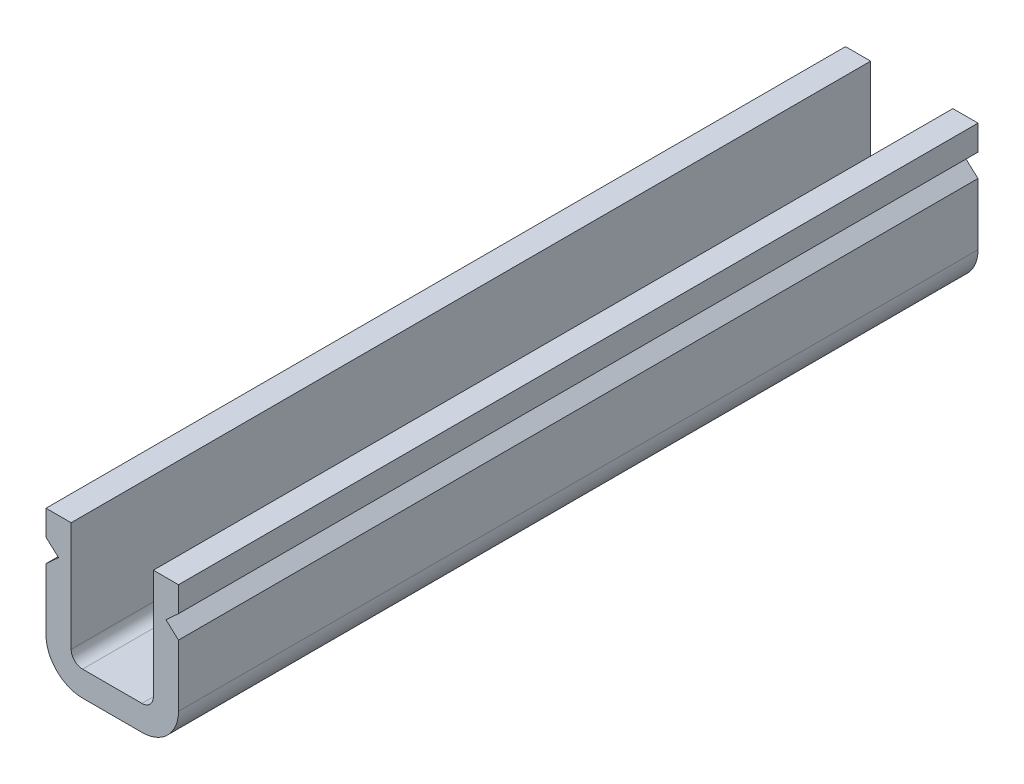
ISO-10303-21;
HEADER;
FILE_DESCRIPTION(('STEP AP214'),'2;1');
FILE_NAME('part.step','',(''),(''),'','','');
FILE_SCHEMA(('AUTOMOTIVE_DESIGN { 1 0 10303 214 1 1 1 1 }'));
ENDSEC;
DATA;
#1=APPLICATION_CONTEXT('core data for automotive mechanical design processes');
#2=APPLICATION_PROTOCOL_DEFINITION('international standard','automotive_design',2000,#1);
#3=PRODUCT_CONTEXT('',#1,'mechanical');
#4=PRODUCT('Part','Part','',(#3));
#5=PRODUCT_RELATED_PRODUCT_CATEGORY('part','',(#4));
#6=PRODUCT_DEFINITION_FORMATION('','',#4);
#7=PRODUCT_DEFINITION_CONTEXT('part definition',#1,'design');
#8=PRODUCT_DEFINITION('design','',#6,#7);
#9=PRODUCT_DEFINITION_SHAPE('','',#8);
#10=(LENGTH_UNIT() NAMED_UNIT(*) SI_UNIT(.MILLI.,.METRE.));
#11=(NAMED_UNIT(*) PLANE_ANGLE_UNIT() SI_UNIT($,.RADIAN.));
#12=(NAMED_UNIT(*) SI_UNIT($,.STERADIAN.) SOLID_ANGLE_UNIT());
#13=UNCERTAINTY_MEASURE_WITH_UNIT(LENGTH_MEASURE(1.E-05),#10,'distance_accuracy_value','');
#14=(GEOMETRIC_REPRESENTATION_CONTEXT(3) GLOBAL_UNCERTAINTY_ASSIGNED_CONTEXT((#13)) GLOBAL_UNIT_ASSIGNED_CONTEXT((#10,
#11,#12)) REPRESENTATION_CONTEXT('',''));
#15=CARTESIAN_POINT('',(0.,0.,0.));
#16=DIRECTION('',(0.,0.,1.));
#17=DIRECTION('',(1.,0.,0.));
#18=AXIS2_PLACEMENT_3D('',#15,#16,#17);
#19=CARTESIAN_POINT('',(3.2,-2.1,35.));
#20=DIRECTION('',(0.,-1.,0.));
#21=DIRECTION('',(0.,0.,-1.));
#22=AXIS2_PLACEMENT_3D('',#19,#20,#21);
#23=PLANE('',#22);
#24=DIRECTION('',(-1.,0.,0.));
#25=VECTOR('',#24,1.);
#26=CARTESIAN_POINT('',(3.2,-2.1,0.));
#27=LINE('',#26,#25);
#28=CARTESIAN_POINT('',(3.2,-2.1,0.));
#29=VERTEX_POINT('',#28);
#30=CARTESIAN_POINT('',(2.1,-2.1,0.));
#31=VERTEX_POINT('',#30);
#32=EDGE_CURVE('E187',#29,#31,#27,.T.);
#33=ORIENTED_EDGE('',*,*,#32,.T.);
#34=DIRECTION('',(0.,0.,-1.));
#35=VECTOR('',#34,1.);
#36=CARTESIAN_POINT('',(2.1,-2.1,35.));
#37=LINE('',#36,#35);
#38=CARTESIAN_POINT('',(2.1,-2.1,35.));
#39=VERTEX_POINT('',#38);
#40=EDGE_CURVE('E11',#39,#31,#37,.T.);
#41=ORIENTED_EDGE('',*,*,#40,.F.);
#42=DIRECTION('',(-1.,0.,0.));
#43=VECTOR('',#42,1.);
#44=CARTESIAN_POINT('',(3.2,-2.1,35.));
#45=LINE('',#44,#43);
#46=CARTESIAN_POINT('',(3.2,-2.1,35.));
#47=VERTEX_POINT('',#46);
#48=EDGE_CURVE('E221',#47,#39,#45,.T.);
#49=ORIENTED_EDGE('',*,*,#48,.F.);
#50=DIRECTION('',(0.,0.,-1.));
#51=VECTOR('',#50,1.);
#52=CARTESIAN_POINT('',(3.2,-2.1,35.));
#53=LINE('',#52,#51);
#54=EDGE_CURVE('E183',#47,#29,#53,.T.);
#55=ORIENTED_EDGE('',*,*,#54,.T.);
#56=EDGE_LOOP('',(#33,#41,#49,#55));
#57=FACE_BOUND('',#56,.T.);
#58=ADVANCED_FACE('F31',(#57),#23,.F.);
#59=CARTESIAN_POINT('',(2.1,-2.1,35.));
#60=DIRECTION('',(1.,0.,0.));
#61=DIRECTION('',(0.,1.,0.));
#62=AXIS2_PLACEMENT_3D('',#59,#60,#61);
#63=PLANE('',#62);
#64=DIRECTION('',(0.,-1.,0.));
#65=VECTOR('',#64,1.);
#66=CARTESIAN_POINT('',(2.1,-2.1,0.));
#67=LINE('',#66,#65);
#68=CARTESIAN_POINT('',(2.10000000000001,-3.2,0.));
#69=VERTEX_POINT('',#68);
#70=EDGE_CURVE('E190',#31,#69,#67,.T.);
#71=ORIENTED_EDGE('',*,*,#70,.T.);
#72=DIRECTION('',(0.,0.,-1.));
#73=VECTOR('',#72,1.);
#74=CARTESIAN_POINT('',(2.10000000000001,-3.2,35.));
#75=LINE('',#74,#73);
#76=CARTESIAN_POINT('',(2.10000000000001,-3.2,35.));
#77=VERTEX_POINT('',#76);
#78=EDGE_CURVE('E39',#77,#69,#75,.T.);
#79=ORIENTED_EDGE('',*,*,#78,.F.);
#80=DIRECTION('',(0.,-1.,0.));
#81=VECTOR('',#80,1.);
#82=CARTESIAN_POINT('',(2.1,-2.1,35.));
#83=LINE('',#82,#81);
#84=EDGE_CURVE('E120',#39,#77,#83,.T.);
#85=ORIENTED_EDGE('',*,*,#84,.F.);
#86=ORIENTED_EDGE('',*,*,#40,.T.);
#87=EDGE_LOOP('',(#71,#79,#85,#86));
#88=FACE_BOUND('',#87,.T.);
#89=ADVANCED_FACE('F329',(#88),#63,.F.);
#90=CARTESIAN_POINT('',(2.10000000000001,-3.2,35.));
#91=DIRECTION('',(0.672672793996314,0.739940073395943,0.));
#92=DIRECTION('',(-0.739940073395943,0.672672793996314,0.));
#93=AXIS2_PLACEMENT_3D('',#90,#91,#92);
#94=PLANE('',#93);
#95=DIRECTION('',(0.739940073395943,-0.672672793996314,0.));
#96=VECTOR('',#95,1.);
#97=CARTESIAN_POINT('',(2.10000000000001,-3.2,0.));
#98=LINE('',#97,#96);
#99=CARTESIAN_POINT('',(2.65,-3.7,0.));
#100=VERTEX_POINT('',#99);
#101=EDGE_CURVE('E192',#69,#100,#98,.T.);
#102=ORIENTED_EDGE('',*,*,#101,.T.);
#103=DIRECTION('',(0.,0.,-1.));
#104=VECTOR('',#103,1.);
#105=CARTESIAN_POINT('',(2.65,-3.7,35.));
#106=LINE('',#105,#104);
#107=CARTESIAN_POINT('',(2.65,-3.7,35.));
#108=VERTEX_POINT('',#107);
#109=EDGE_CURVE('E258',#108,#100,#106,.T.);
#110=ORIENTED_EDGE('',*,*,#109,.F.);
#111=DIRECTION('',(0.739940073395943,-0.672672793996314,0.));
#112=VECTOR('',#111,1.);
#113=CARTESIAN_POINT('',(2.10000000000001,-3.2,35.));
#114=LINE('',#113,#112);
#115=EDGE_CURVE('E266',#77,#108,#114,.T.);
#116=ORIENTED_EDGE('',*,*,#115,.F.);
#117=ORIENTED_EDGE('',*,*,#78,.T.);
#118=EDGE_LOOP('',(#102,#110,#116,#117));
#119=FACE_BOUND('',#118,.T.);
#120=ADVANCED_FACE('F264',(#119),#94,.F.);
#121=CARTESIAN_POINT('',(2.10000000000001,-4.2,35.));
#122=DIRECTION('',(0.672672793996314,-0.739940073395943,0.));
#123=DIRECTION('',(0.739940073395943,0.672672793996314,0.));
#124=AXIS2_PLACEMENT_3D('',#121,#122,#123);
#125=PLANE('',#124);
#126=DIRECTION('',(-0.739940073395943,-0.672672793996314,0.));
#127=VECTOR('',#126,1.);
#128=CARTESIAN_POINT('',(2.10000000000001,-4.2,0.));
#129=LINE('',#128,#127);
#130=CARTESIAN_POINT('',(2.10000000000001,-4.2,0.));
#131=VERTEX_POINT('',#130);
#132=EDGE_CURVE('E194',#100,#131,#129,.T.);
#133=ORIENTED_EDGE('',*,*,#132,.T.);
#134=DIRECTION('',(0.,0.,-1.));
#135=VECTOR('',#134,1.);
#136=CARTESIAN_POINT('',(2.10000000000001,-4.2,35.));
#137=LINE('',#136,#135);
#138=CARTESIAN_POINT('',(2.10000000000001,-4.2,35.));
#139=VERTEX_POINT('',#138);
#140=EDGE_CURVE('E255',#139,#131,#137,.T.);
#141=ORIENTED_EDGE('',*,*,#140,.F.);
#142=DIRECTION('',(-0.739940073395943,-0.672672793996314,0.));
#143=VECTOR('',#142,1.);
#144=CARTESIAN_POINT('',(2.10000000000001,-4.2,35.));
#145=LINE('',#144,#143);
#146=EDGE_CURVE('E284',#108,#139,#145,.T.);
#147=ORIENTED_EDGE('',*,*,#146,.F.);
#148=ORIENTED_EDGE('',*,*,#109,.T.);
#149=EDGE_LOOP('',(#133,#141,#147,#148));
#150=FACE_BOUND('',#149,.T.);
#151=ADVANCED_FACE('F275',(#150),#125,.F.);
#152=CARTESIAN_POINT('',(2.10000000000001,-4.2,35.));
#153=DIRECTION('',(1.,0.,0.));
#154=DIRECTION('',(0.,1.,0.));
#155=AXIS2_PLACEMENT_3D('',#152,#153,#154);
#156=PLANE('',#155);
#157=DIRECTION('',(0.,-1.,0.));
#158=VECTOR('',#157,1.);
#159=CARTESIAN_POINT('',(2.10000000000001,-4.2,0.));
#160=LINE('',#159,#158);
#161=CARTESIAN_POINT('',(2.1,-6.89999999999999,0.));
#162=VERTEX_POINT('',#161);
#163=EDGE_CURVE('E196',#131,#162,#160,.T.);
#164=ORIENTED_EDGE('',*,*,#163,.T.);
#165=DIRECTION('',(0.,0.,-1.));
#166=VECTOR('',#165,1.);
#167=CARTESIAN_POINT('',(2.1,-6.89999999999999,35.));
#168=LINE('',#167,#166);
#169=CARTESIAN_POINT('',(2.1,-6.89999999999999,35.));
#170=VERTEX_POINT('',#169);
#171=EDGE_CURVE('E252',#170,#162,#168,.T.);
#172=ORIENTED_EDGE('',*,*,#171,.F.);
#173=DIRECTION('',(0.,-1.,0.));
#174=VECTOR('',#173,1.);
#175=CARTESIAN_POINT('',(2.10000000000001,-4.2,35.));
#176=LINE('',#175,#174);
#177=EDGE_CURVE('E281',#139,#170,#176,.T.);
#178=ORIENTED_EDGE('',*,*,#177,.F.);
#179=ORIENTED_EDGE('',*,*,#140,.T.);
#180=EDGE_LOOP('',(#164,#172,#178,#179));
#181=FACE_BOUND('',#180,.T.);
#182=ADVANCED_FACE('F279',(#181),#156,.F.);
#183=CARTESIAN_POINT('',(3.7,-6.9,35.));
#184=DIRECTION('',(0.,0.,-1.));
#185=DIRECTION('',(-1.,0.,0.));
#186=AXIS2_PLACEMENT_3D('',#183,#184,#185);
#187=CYLINDRICAL_SURFACE('',#186,1.6);
#188=CARTESIAN_POINT('',(3.7,-6.9,0.));
#189=DIRECTION('',(0.,0.,1.));
#190=DIRECTION('',(1.,0.,0.));
#191=AXIS2_PLACEMENT_3D('',#188,#189,#190);
#192=CIRCLE('',#191,1.6);
#193=CARTESIAN_POINT('',(3.70000000000001,-8.5,0.));
#194=VERTEX_POINT('',#193);
#195=EDGE_CURVE('E198',#162,#194,#192,.T.);
#196=ORIENTED_EDGE('',*,*,#195,.T.);
#197=DIRECTION('',(0.,0.,-1.));
#198=VECTOR('',#197,1.);
#199=CARTESIAN_POINT('',(3.70000000000001,-8.5,35.));
#200=LINE('',#199,#198);
#201=CARTESIAN_POINT('',(3.70000000000001,-8.5,35.));
#202=VERTEX_POINT('',#201);
#203=EDGE_CURVE('E249',#202,#194,#200,.T.);
#204=ORIENTED_EDGE('',*,*,#203,.F.);
#205=CARTESIAN_POINT('',(3.7,-6.9,35.));
#206=DIRECTION('',(0.,0.,1.));
#207=DIRECTION('',(1.,0.,0.));
#208=AXIS2_PLACEMENT_3D('',#205,#206,#207);
#209=CIRCLE('',#208,1.6);
#210=EDGE_CURVE('E283',#170,#202,#209,.T.);
#211=ORIENTED_EDGE('',*,*,#210,.F.);
#212=ORIENTED_EDGE('',*,*,#171,.T.);
#213=EDGE_LOOP('',(#196,#204,#211,#212));
#214=FACE_BOUND('',#213,.T.);
#215=ADVANCED_FACE('F342',(#214),#187,.T.);
#216=CARTESIAN_POINT('',(3.70000000000001,-8.5,35.));
#217=DIRECTION('',(0.,1.,0.));
#218=DIRECTION('',(0.,0.,1.));
#219=AXIS2_PLACEMENT_3D('',#216,#217,#218);
#220=PLANE('',#219);
#221=DIRECTION('',(1.,0.,0.));
#222=VECTOR('',#221,1.);
#223=CARTESIAN_POINT('',(3.70000000000001,-8.5,0.));
#224=LINE('',#223,#222);
#225=CARTESIAN_POINT('',(6.29999999999999,-8.5,0.));
#226=VERTEX_POINT('',#225);
#227=EDGE_CURVE('E200',#194,#226,#224,.T.);
#228=ORIENTED_EDGE('',*,*,#227,.T.);
#229=DIRECTION('',(0.,0.,-1.));
#230=VECTOR('',#229,1.);
#231=CARTESIAN_POINT('',(6.29999999999999,-8.5,35.));
#232=LINE('',#231,#230);
#233=CARTESIAN_POINT('',(6.29999999999999,-8.5,35.));
#234=VERTEX_POINT('',#233);
#235=EDGE_CURVE('E246',#234,#226,#232,.T.);
#236=ORIENTED_EDGE('',*,*,#235,.F.);
#237=DIRECTION('',(1.,0.,0.));
#238=VECTOR('',#237,1.);
#239=CARTESIAN_POINT('',(3.70000000000001,-8.5,35.));
#240=LINE('',#239,#238);
#241=EDGE_CURVE('E286',#202,#234,#240,.T.);
#242=ORIENTED_EDGE('',*,*,#241,.F.);
#243=ORIENTED_EDGE('',*,*,#203,.T.);
#244=EDGE_LOOP('',(#228,#236,#242,#243));
#245=FACE_BOUND('',#244,.T.);
#246=ADVANCED_FACE('F345',(#245),#220,.F.);
#247=CARTESIAN_POINT('',(6.3,-6.9,35.));
#248=DIRECTION('',(0.,0.,-1.));
#249=DIRECTION('',(-1.,0.,0.));
#250=AXIS2_PLACEMENT_3D('',#247,#248,#249);
#251=CYLINDRICAL_SURFACE('',#250,1.6);
#252=CARTESIAN_POINT('',(6.3,-6.9,0.));
#253=DIRECTION('',(0.,0.,1.));
#254=DIRECTION('',(1.,0.,0.));
#255=AXIS2_PLACEMENT_3D('',#252,#253,#254);
#256=CIRCLE('',#255,1.6);
#257=CARTESIAN_POINT('',(7.9,-6.89999999999999,0.));
#258=VERTEX_POINT('',#257);
#259=EDGE_CURVE('E202',#226,#258,#256,.T.);
#260=ORIENTED_EDGE('',*,*,#259,.T.);
#261=DIRECTION('',(0.,0.,-1.));
#262=VECTOR('',#261,1.);
#263=CARTESIAN_POINT('',(7.9,-6.89999999999999,35.));
#264=LINE('',#263,#262);
#265=CARTESIAN_POINT('',(7.9,-6.89999999999999,35.));
#266=VERTEX_POINT('',#265);
#267=EDGE_CURVE('E243',#266,#258,#264,.T.);
#268=ORIENTED_EDGE('',*,*,#267,.F.);
#269=CARTESIAN_POINT('',(6.3,-6.9,35.));
#270=DIRECTION('',(0.,0.,1.));
#271=DIRECTION('',(1.,0.,0.));
#272=AXIS2_PLACEMENT_3D('',#269,#270,#271);
#273=CIRCLE('',#272,1.6);
#274=EDGE_CURVE('E292',#234,#266,#273,.T.);
#275=ORIENTED_EDGE('',*,*,#274,.F.);
#276=ORIENTED_EDGE('',*,*,#235,.T.);
#277=EDGE_LOOP('',(#260,#268,#275,#276));
#278=FACE_BOUND('',#277,.T.);
#279=ADVANCED_FACE('F349',(#278),#251,.T.);
#280=CARTESIAN_POINT('',(7.9,-6.89999999999999,35.));
#281=DIRECTION('',(-1.,0.,0.));
#282=DIRECTION('',(0.,-1.,0.));
#283=AXIS2_PLACEMENT_3D('',#280,#281,#282);
#284=PLANE('',#283);
#285=DIRECTION('',(0.,1.,0.));
#286=VECTOR('',#285,1.);
#287=CARTESIAN_POINT('',(7.9,-6.89999999999999,0.));
#288=LINE('',#287,#286);
#289=CARTESIAN_POINT('',(7.9,-4.2,0.));
#290=VERTEX_POINT('',#289);
#291=EDGE_CURVE('E204',#258,#290,#288,.T.);
#292=ORIENTED_EDGE('',*,*,#291,.T.);
#293=DIRECTION('',(0.,0.,-1.));
#294=VECTOR('',#293,1.);
#295=CARTESIAN_POINT('',(7.9,-4.2,35.));
#296=LINE('',#295,#294);
#297=CARTESIAN_POINT('',(7.9,-4.2,35.));
#298=VERTEX_POINT('',#297);
#299=EDGE_CURVE('E240',#298,#290,#296,.T.);
#300=ORIENTED_EDGE('',*,*,#299,.F.);
#301=DIRECTION('',(0.,1.,0.));
#302=VECTOR('',#301,1.);
#303=CARTESIAN_POINT('',(7.9,-6.89999999999999,35.));
#304=LINE('',#303,#302);
#305=EDGE_CURVE('E294',#266,#298,#304,.T.);
#306=ORIENTED_EDGE('',*,*,#305,.F.);
#307=ORIENTED_EDGE('',*,*,#267,.T.);
#308=EDGE_LOOP('',(#292,#300,#306,#307));
#309=FACE_BOUND('',#308,.T.);
#310=ADVANCED_FACE('F353',(#309),#284,.F.);
#311=CARTESIAN_POINT('',(7.9,-4.2,35.));
#312=DIRECTION('',(-0.672672793996314,-0.739940073395943,0.));
#313=DIRECTION('',(0.739940073395943,-0.672672793996314,0.));
#314=AXIS2_PLACEMENT_3D('',#311,#312,#313);
#315=PLANE('',#314);
#316=DIRECTION('',(-0.739940073395943,0.672672793996314,0.));
#317=VECTOR('',#316,1.);
#318=CARTESIAN_POINT('',(7.9,-4.2,0.));
#319=LINE('',#318,#317);
#320=CARTESIAN_POINT('',(7.35,-3.7,0.));
#321=VERTEX_POINT('',#320);
#322=EDGE_CURVE('E206',#290,#321,#319,.T.);
#323=ORIENTED_EDGE('',*,*,#322,.T.);
#324=DIRECTION('',(0.,0.,-1.));
#325=VECTOR('',#324,1.);
#326=CARTESIAN_POINT('',(7.35,-3.7,35.));
#327=LINE('',#326,#325);
#328=CARTESIAN_POINT('',(7.35,-3.7,35.));
#329=VERTEX_POINT('',#328);
#330=EDGE_CURVE('E237',#329,#321,#327,.T.);
#331=ORIENTED_EDGE('',*,*,#330,.F.);
#332=DIRECTION('',(-0.739940073395943,0.672672793996314,0.));
#333=VECTOR('',#332,1.);
#334=CARTESIAN_POINT('',(7.9,-4.2,35.));
#335=LINE('',#334,#333);
#336=EDGE_CURVE('E296',#298,#329,#335,.T.);
#337=ORIENTED_EDGE('',*,*,#336,.F.);
#338=ORIENTED_EDGE('',*,*,#299,.T.);
#339=EDGE_LOOP('',(#323,#331,#337,#338));
#340=FACE_BOUND('',#339,.T.);
#341=ADVANCED_FACE('F357',(#340),#315,.F.);
#342=CARTESIAN_POINT('',(7.9,-3.2,35.));
#343=DIRECTION('',(-0.672672793996314,0.739940073395943,0.));
#344=DIRECTION('',(-0.739940073395943,-0.672672793996314,0.));
#345=AXIS2_PLACEMENT_3D('',#342,#343,#344);
#346=PLANE('',#345);
#347=DIRECTION('',(0.739940073395943,0.672672793996314,0.));
#348=VECTOR('',#347,1.);
#349=CARTESIAN_POINT('',(7.9,-3.2,0.));
#350=LINE('',#349,#348);
#351=CARTESIAN_POINT('',(7.9,-3.2,0.));
#352=VERTEX_POINT('',#351);
#353=EDGE_CURVE('E208',#321,#352,#350,.T.);
#354=ORIENTED_EDGE('',*,*,#353,.T.);
#355=DIRECTION('',(0.,0.,-1.));
#356=VECTOR('',#355,1.);
#357=CARTESIAN_POINT('',(7.9,-3.2,35.));
#358=LINE('',#357,#356);
#359=CARTESIAN_POINT('',(7.9,-3.2,35.));
#360=VERTEX_POINT('',#359);
#361=EDGE_CURVE('E234',#360,#352,#358,.T.);
#362=ORIENTED_EDGE('',*,*,#361,.F.);
#363=DIRECTION('',(0.739940073395943,0.672672793996314,0.));
#364=VECTOR('',#363,1.);
#365=CARTESIAN_POINT('',(7.9,-3.2,35.));
#366=LINE('',#365,#364);
#367=EDGE_CURVE('E298',#329,#360,#366,.T.);
#368=ORIENTED_EDGE('',*,*,#367,.F.);
#369=ORIENTED_EDGE('',*,*,#330,.T.);
#370=EDGE_LOOP('',(#354,#362,#368,#369));
#371=FACE_BOUND('',#370,.T.);
#372=ADVANCED_FACE('F361',(#371),#346,.F.);
#373=CARTESIAN_POINT('',(7.9,-3.2,35.));
#374=DIRECTION('',(-1.,0.,0.));
#375=DIRECTION('',(0.,-1.,0.));
#376=AXIS2_PLACEMENT_3D('',#373,#374,#375);
#377=PLANE('',#376);
#378=DIRECTION('',(0.,1.,0.));
#379=VECTOR('',#378,1.);
#380=CARTESIAN_POINT('',(7.9,-3.2,0.));
#381=LINE('',#380,#379);
#382=CARTESIAN_POINT('',(7.9,-2.1,0.));
#383=VERTEX_POINT('',#382);
#384=EDGE_CURVE('E210',#352,#383,#381,.T.);
#385=ORIENTED_EDGE('',*,*,#384,.T.);
#386=DIRECTION('',(0.,0.,-1.));
#387=VECTOR('',#386,1.);
#388=CARTESIAN_POINT('',(7.9,-2.1,35.));
#389=LINE('',#388,#387);
#390=CARTESIAN_POINT('',(7.9,-2.1,35.));
#391=VERTEX_POINT('',#390);
#392=EDGE_CURVE('E231',#391,#383,#389,.T.);
#393=ORIENTED_EDGE('',*,*,#392,.F.);
#394=DIRECTION('',(0.,1.,0.));
#395=VECTOR('',#394,1.);
#396=CARTESIAN_POINT('',(7.9,-3.2,35.));
#397=LINE('',#396,#395);
#398=EDGE_CURVE('E300',#360,#391,#397,.T.);
#399=ORIENTED_EDGE('',*,*,#398,.F.);
#400=ORIENTED_EDGE('',*,*,#361,.T.);
#401=EDGE_LOOP('',(#385,#393,#399,#400));
#402=FACE_BOUND('',#401,.T.);
#403=ADVANCED_FACE('F365',(#402),#377,.F.);
#404=CARTESIAN_POINT('',(7.9,-2.1,35.));
#405=DIRECTION('',(0.,-1.,0.));
#406=DIRECTION('',(1.,0.,0.));
#407=AXIS2_PLACEMENT_3D('',#404,#405,#406);
#408=PLANE('',#407);
#409=DIRECTION('',(-1.,0.,0.));
#410=VECTOR('',#409,1.);
#411=CARTESIAN_POINT('',(7.9,-2.1,0.));
#412=LINE('',#411,#410);
#413=CARTESIAN_POINT('',(6.8,-2.1,0.));
#414=VERTEX_POINT('',#413);
#415=EDGE_CURVE('E212',#383,#414,#412,.T.);
#416=ORIENTED_EDGE('',*,*,#415,.T.);
#417=DIRECTION('',(0.,0.,-1.));
#418=VECTOR('',#417,1.);
#419=CARTESIAN_POINT('',(6.8,-2.1,35.));
#420=LINE('',#419,#418);
#421=CARTESIAN_POINT('',(6.8,-2.1,35.));
#422=VERTEX_POINT('',#421);
#423=EDGE_CURVE('E228',#422,#414,#420,.T.);
#424=ORIENTED_EDGE('',*,*,#423,.F.);
#425=DIRECTION('',(-1.,0.,0.));
#426=VECTOR('',#425,1.);
#427=CARTESIAN_POINT('',(7.9,-2.1,35.));
#428=LINE('',#427,#426);
#429=EDGE_CURVE('E302',#391,#422,#428,.T.);
#430=ORIENTED_EDGE('',*,*,#429,.F.);
#431=ORIENTED_EDGE('',*,*,#392,.T.);
#432=EDGE_LOOP('',(#416,#424,#430,#431));
#433=FACE_BOUND('',#432,.T.);
#434=ADVANCED_FACE('F369',(#433),#408,.F.);
#435=CARTESIAN_POINT('',(6.8,-6.9,35.));
#436=DIRECTION('',(1.,0.,0.));
#437=DIRECTION('',(0.,0.,-1.));
#438=AXIS2_PLACEMENT_3D('',#435,#436,#437);
#439=PLANE('',#438);
#440=DIRECTION('',(0.,-1.,0.));
#441=VECTOR('',#440,1.);
#442=CARTESIAN_POINT('',(6.8,-6.9,0.));
#443=LINE('',#442,#441);
#444=CARTESIAN_POINT('',(6.8,-6.9,0.));
#445=VERTEX_POINT('',#444);
#446=EDGE_CURVE('E214',#414,#445,#443,.T.);
#447=ORIENTED_EDGE('',*,*,#446,.T.);
#448=DIRECTION('',(0.,0.,-1.));
#449=VECTOR('',#448,1.);
#450=CARTESIAN_POINT('',(6.8,-6.9,35.));
#451=LINE('',#450,#449);
#452=CARTESIAN_POINT('',(6.8,-6.9,35.));
#453=VERTEX_POINT('',#452);
#454=EDGE_CURVE('E225',#453,#445,#451,.T.);
#455=ORIENTED_EDGE('',*,*,#454,.F.);
#456=DIRECTION('',(0.,-1.,0.));
#457=VECTOR('',#456,1.);
#458=CARTESIAN_POINT('',(6.8,-6.9,35.));
#459=LINE('',#458,#457);
#460=EDGE_CURVE('E304',#422,#453,#459,.T.);
#461=ORIENTED_EDGE('',*,*,#460,.F.);
#462=ORIENTED_EDGE('',*,*,#423,.T.);
#463=EDGE_LOOP('',(#447,#455,#461,#462));
#464=FACE_BOUND('',#463,.T.);
#465=ADVANCED_FACE('F310',(#464),#439,.F.);
#466=CARTESIAN_POINT('',(6.3,-6.9,35.));
#467=DIRECTION('',(0.,0.,-1.));
#468=DIRECTION('',(-1.,0.,0.));
#469=AXIS2_PLACEMENT_3D('',#466,#467,#468);
#470=CYLINDRICAL_SURFACE('',#469,0.5);
#471=CARTESIAN_POINT('',(6.3,-6.9,0.));
#472=DIRECTION('',(0.,0.,-1.));
#473=DIRECTION('',(-1.,0.,0.));
#474=AXIS2_PLACEMENT_3D('',#471,#472,#473);
#475=CIRCLE('',#474,0.5);
#476=CARTESIAN_POINT('',(6.3,-7.4,0.));
#477=VERTEX_POINT('',#476);
#478=EDGE_CURVE('E216',#445,#477,#475,.T.);
#479=ORIENTED_EDGE('',*,*,#478,.T.);
#480=DIRECTION('',(0.,0.,-1.));
#481=VECTOR('',#480,1.);
#482=CARTESIAN_POINT('',(6.3,-7.4,35.));
#483=LINE('',#482,#481);
#484=CARTESIAN_POINT('',(6.3,-7.4,35.));
#485=VERTEX_POINT('',#484);
#486=EDGE_CURVE('E178',#485,#477,#483,.T.);
#487=ORIENTED_EDGE('',*,*,#486,.F.);
#488=CARTESIAN_POINT('',(6.3,-6.9,35.));
#489=DIRECTION('',(0.,0.,-1.));
#490=DIRECTION('',(-1.,0.,0.));
#491=AXIS2_PLACEMENT_3D('',#488,#489,#490);
#492=CIRCLE('',#491,0.5);
#493=EDGE_CURVE('E169',#453,#485,#492,.T.);
#494=ORIENTED_EDGE('',*,*,#493,.F.);
#495=ORIENTED_EDGE('',*,*,#454,.T.);
#496=EDGE_LOOP('',(#479,#487,#494,#495));
#497=FACE_BOUND('',#496,.T.);
#498=ADVANCED_FACE('F314',(#497),#470,.F.);
#499=CARTESIAN_POINT('',(3.7,-7.4,35.));
#500=DIRECTION('',(0.,-1.,0.));
#501=DIRECTION('',(0.,0.,-1.));
#502=AXIS2_PLACEMENT_3D('',#499,#500,#501);
#503=PLANE('',#502);
#504=DIRECTION('',(-1.,0.,0.));
#505=VECTOR('',#504,1.);
#506=CARTESIAN_POINT('',(3.7,-7.4,0.));
#507=LINE('',#506,#505);
#508=CARTESIAN_POINT('',(3.7,-7.4,0.));
#509=VERTEX_POINT('',#508);
#510=EDGE_CURVE('E177',#477,#509,#507,.T.);
#511=ORIENTED_EDGE('',*,*,#510,.T.);
#512=DIRECTION('',(0.,0.,-1.));
#513=VECTOR('',#512,1.);
#514=CARTESIAN_POINT('',(3.7,-7.4,35.));
#515=LINE('',#514,#513);
#516=CARTESIAN_POINT('',(3.7,-7.4,35.));
#517=VERTEX_POINT('',#516);
#518=EDGE_CURVE('E174',#517,#509,#515,.T.);
#519=ORIENTED_EDGE('',*,*,#518,.F.);
#520=DIRECTION('',(-1.,0.,0.));
#521=VECTOR('',#520,1.);
#522=CARTESIAN_POINT('',(3.7,-7.4,35.));
#523=LINE('',#522,#521);
#524=EDGE_CURVE('E163',#485,#517,#523,.T.);
#525=ORIENTED_EDGE('',*,*,#524,.F.);
#526=ORIENTED_EDGE('',*,*,#486,.T.);
#527=EDGE_LOOP('',(#511,#519,#525,#526));
#528=FACE_BOUND('',#527,.T.);
#529=ADVANCED_FACE('F175',(#528),#503,.F.);
#530=CARTESIAN_POINT('',(3.7,-6.9,35.));
#531=DIRECTION('',(0.,0.,-1.));
#532=DIRECTION('',(-1.,0.,0.));
#533=AXIS2_PLACEMENT_3D('',#530,#531,#532);
#534=CYLINDRICAL_SURFACE('',#533,0.5);
#535=CARTESIAN_POINT('',(3.7,-6.9,0.));
#536=DIRECTION('',(0.,0.,-1.));
#537=DIRECTION('',(1.,0.,0.));
#538=AXIS2_PLACEMENT_3D('',#535,#536,#537);
#539=CIRCLE('',#538,0.5);
#540=CARTESIAN_POINT('',(3.2,-6.9,0.));
#541=VERTEX_POINT('',#540);
#542=EDGE_CURVE('E106',#509,#541,#539,.T.);
#543=ORIENTED_EDGE('',*,*,#542,.T.);
#544=DIRECTION('',(0.,0.,-1.));
#545=VECTOR('',#544,1.);
#546=CARTESIAN_POINT('',(3.2,-6.9,35.));
#547=LINE('',#546,#545);
#548=CARTESIAN_POINT('',(3.2,-6.9,35.));
#549=VERTEX_POINT('',#548);
#550=EDGE_CURVE('E179',#549,#541,#547,.T.);
#551=ORIENTED_EDGE('',*,*,#550,.F.);
#552=CARTESIAN_POINT('',(3.7,-6.9,35.));
#553=DIRECTION('',(0.,0.,-1.));
#554=DIRECTION('',(1.,0.,0.));
#555=AXIS2_PLACEMENT_3D('',#552,#553,#554);
#556=CIRCLE('',#555,0.5);
#557=EDGE_CURVE('E167',#517,#549,#556,.T.);
#558=ORIENTED_EDGE('',*,*,#557,.F.);
#559=ORIENTED_EDGE('',*,*,#518,.T.);
#560=EDGE_LOOP('',(#543,#551,#558,#559));
#561=FACE_BOUND('',#560,.T.);
#562=ADVANCED_FACE('F181',(#561),#534,.F.);
#563=CARTESIAN_POINT('',(3.2,-2.1,35.));
#564=DIRECTION('',(-1.,0.,0.));
#565=DIRECTION('',(0.,0.,1.));
#566=AXIS2_PLACEMENT_3D('',#563,#564,#565);
#567=PLANE('',#566);
#568=DIRECTION('',(0.,1.,0.));
#569=VECTOR('',#568,1.);
#570=CARTESIAN_POINT('',(3.2,-2.1,0.));
#571=LINE('',#570,#569);
#572=EDGE_CURVE('E112',#541,#29,#571,.T.);
#573=ORIENTED_EDGE('',*,*,#572,.T.);
#574=ORIENTED_EDGE('',*,*,#54,.F.);
#575=DIRECTION('',(0.,1.,0.));
#576=VECTOR('',#575,1.);
#577=CARTESIAN_POINT('',(3.2,-2.1,35.));
#578=LINE('',#577,#576);
#579=EDGE_CURVE('E47',#549,#47,#578,.T.);
#580=ORIENTED_EDGE('',*,*,#579,.F.);
#581=ORIENTED_EDGE('',*,*,#550,.T.);
#582=EDGE_LOOP('',(#573,#574,#580,#581));
#583=FACE_BOUND('',#582,.T.);
#584=ADVANCED_FACE('F318',(#583),#567,.F.);
#585=CARTESIAN_POINT('',(3.7,-6.9,35.));
#586=DIRECTION('',(0.,0.,1.));
#587=DIRECTION('',(1.,0.,0.));
#588=AXIS2_PLACEMENT_3D('',#585,#586,#587);
#589=PLANE('',#588);
#590=ORIENTED_EDGE('',*,*,#48,.T.);
#591=ORIENTED_EDGE('',*,*,#84,.T.);
#592=ORIENTED_EDGE('',*,*,#115,.T.);
#593=ORIENTED_EDGE('',*,*,#146,.T.);
#594=ORIENTED_EDGE('',*,*,#177,.T.);
#595=ORIENTED_EDGE('',*,*,#210,.T.);
#596=ORIENTED_EDGE('',*,*,#241,.T.);
#597=ORIENTED_EDGE('',*,*,#274,.T.);
#598=ORIENTED_EDGE('',*,*,#305,.T.);
#599=ORIENTED_EDGE('',*,*,#336,.T.);
#600=ORIENTED_EDGE('',*,*,#367,.T.);
#601=ORIENTED_EDGE('',*,*,#398,.T.);
#602=ORIENTED_EDGE('',*,*,#429,.T.);
#603=ORIENTED_EDGE('',*,*,#460,.T.);
#604=ORIENTED_EDGE('',*,*,#493,.T.);
#605=ORIENTED_EDGE('',*,*,#524,.T.);
#606=ORIENTED_EDGE('',*,*,#557,.T.);
#607=ORIENTED_EDGE('',*,*,#579,.T.);
#608=EDGE_LOOP('',(#590,#591,#592,#593,#594,#595,#596,#597,#598,#599,#600,#601,#602,#603,#604,
#605,#606,#607));
#609=FACE_BOUND('',#608,.T.);
#610=ADVANCED_FACE('F165',(#609),#589,.T.);
#611=CARTESIAN_POINT('',(3.7,-6.9,0.));
#612=DIRECTION('',(0.,0.,1.));
#613=DIRECTION('',(1.,0.,0.));
#614=AXIS2_PLACEMENT_3D('',#611,#612,#613);
#615=PLANE('',#614);
#616=ORIENTED_EDGE('',*,*,#32,.F.);
#617=ORIENTED_EDGE('',*,*,#572,.F.);
#618=ORIENTED_EDGE('',*,*,#542,.F.);
#619=ORIENTED_EDGE('',*,*,#510,.F.);
#620=ORIENTED_EDGE('',*,*,#478,.F.);
#621=ORIENTED_EDGE('',*,*,#446,.F.);
#622=ORIENTED_EDGE('',*,*,#415,.F.);
#623=ORIENTED_EDGE('',*,*,#384,.F.);
#624=ORIENTED_EDGE('',*,*,#353,.F.);
#625=ORIENTED_EDGE('',*,*,#322,.F.);
#626=ORIENTED_EDGE('',*,*,#291,.F.);
#627=ORIENTED_EDGE('',*,*,#259,.F.);
#628=ORIENTED_EDGE('',*,*,#227,.F.);
#629=ORIENTED_EDGE('',*,*,#195,.F.);
#630=ORIENTED_EDGE('',*,*,#163,.F.);
#631=ORIENTED_EDGE('',*,*,#132,.F.);
#632=ORIENTED_EDGE('',*,*,#101,.F.);
#633=ORIENTED_EDGE('',*,*,#70,.F.);
#634=EDGE_LOOP('',(#616,#617,#618,#619,#620,#621,#622,#623,#624,#625,#626,#627,#628,#629,#630,
#631,#632,#633));
#635=FACE_BOUND('',#634,.T.);
#636=ADVANCED_FACE('F270',(#635),#615,.F.);
#637=CLOSED_SHELL('',(#58,#89,#120,#151,#182,#215,#246,#279,#310,#341,#372,#403,#434,#465,#498,
#529,#562,#584,#610,#636));
#638=MANIFOLD_SOLID_BREP('B2',#637);
#639=ADVANCED_BREP_SHAPE_REPRESENTATION('',(#18,#638),#14);
#640=SHAPE_DEFINITION_REPRESENTATION(#9,#639);
ENDSEC;
END-ISO-10303-21;
